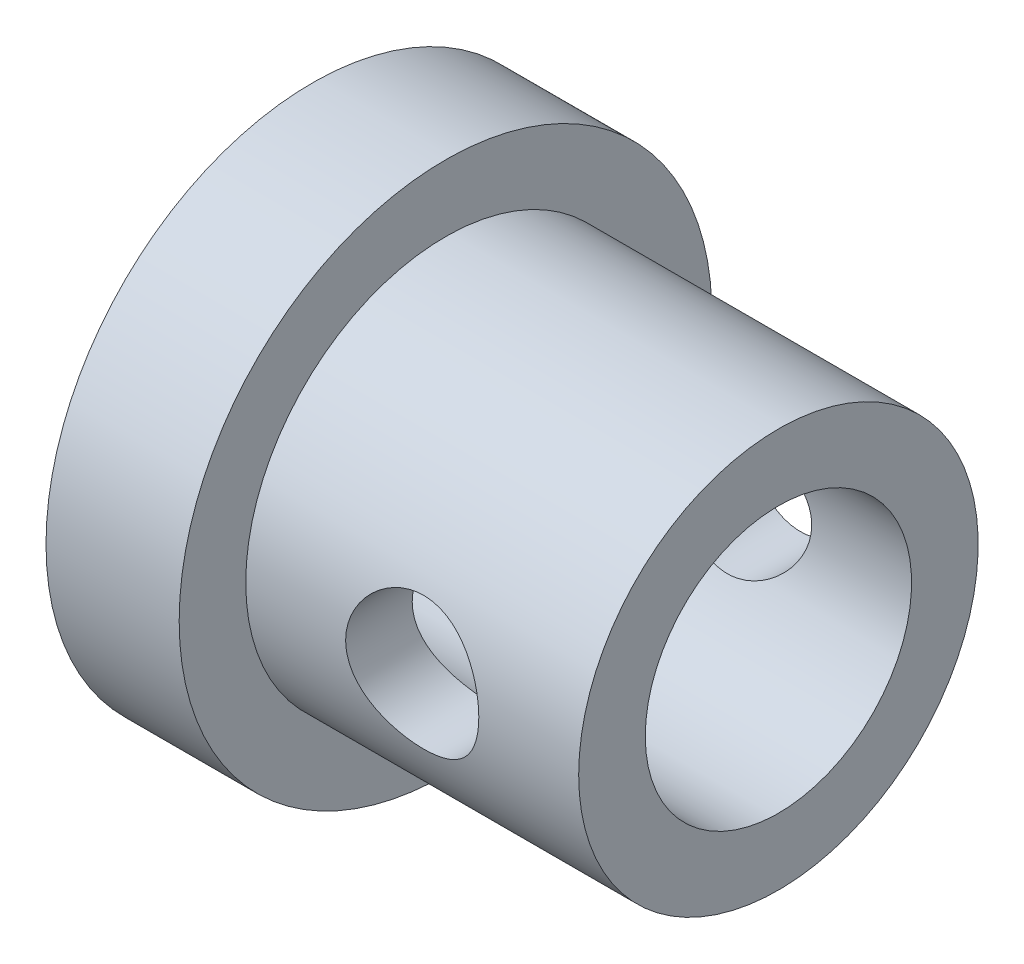
ISO-10303-21;
HEADER;
FILE_DESCRIPTION(('STEP AP214'),'2;1');
FILE_NAME('part.step','',(''),(''),'','','');
FILE_SCHEMA(('AUTOMOTIVE_DESIGN { 1 0 10303 214 1 1 1 1 }'));
ENDSEC;
DATA;
#1=APPLICATION_CONTEXT('core data for automotive mechanical design processes');
#2=APPLICATION_PROTOCOL_DEFINITION('international standard','automotive_design',2000,#1);
#3=PRODUCT_CONTEXT('',#1,'mechanical');
#4=PRODUCT('Part','Part','',(#3));
#5=PRODUCT_RELATED_PRODUCT_CATEGORY('part','',(#4));
#6=PRODUCT_DEFINITION_FORMATION('','',#4);
#7=PRODUCT_DEFINITION_CONTEXT('part definition',#1,'design');
#8=PRODUCT_DEFINITION('design','',#6,#7);
#9=PRODUCT_DEFINITION_SHAPE('','',#8);
#10=(LENGTH_UNIT() NAMED_UNIT(*) SI_UNIT(.MILLI.,.METRE.));
#11=(NAMED_UNIT(*) PLANE_ANGLE_UNIT() SI_UNIT($,.RADIAN.));
#12=(NAMED_UNIT(*) SI_UNIT($,.STERADIAN.) SOLID_ANGLE_UNIT());
#13=UNCERTAINTY_MEASURE_WITH_UNIT(LENGTH_MEASURE(1.E-05),#10,'distance_accuracy_value','');
#14=(GEOMETRIC_REPRESENTATION_CONTEXT(3) GLOBAL_UNCERTAINTY_ASSIGNED_CONTEXT((#13)) GLOBAL_UNIT_ASSIGNED_CONTEXT((#10,
#11,#12)) REPRESENTATION_CONTEXT('',''));
#15=CARTESIAN_POINT('',(0.,0.,0.));
#16=DIRECTION('',(0.,0.,1.));
#17=DIRECTION('',(1.,0.,0.));
#18=AXIS2_PLACEMENT_3D('',#15,#16,#17);
#19=CARTESIAN_POINT('',(0.,4.,0.));
#20=DIRECTION('',(1.,0.,0.));
#21=DIRECTION('',(0.,0.,-1.));
#22=AXIS2_PLACEMENT_3D('',#19,#20,#21);
#23=PLANE('',#22);
#24=CARTESIAN_POINT('',(0.,0.,0.));
#25=DIRECTION('',(-1.,0.,0.));
#26=DIRECTION('',(0.,0.,1.));
#27=AXIS2_PLACEMENT_3D('',#24,#25,#26);
#28=CIRCLE('',#27,2.);
#29=CARTESIAN_POINT('',(0.,0.,2.));
#30=VERTEX_POINT('',#29);
#31=EDGE_CURVE('E106',#30,#30,#28,.T.);
#32=ORIENTED_EDGE('',*,*,#31,.F.);
#33=EDGE_LOOP('',(#32));
#34=FACE_BOUND('',#33,.T.);
#35=CARTESIAN_POINT('',(0.,0.,0.));
#36=DIRECTION('',(-1.,0.,0.));
#37=DIRECTION('',(0.,0.,1.));
#38=AXIS2_PLACEMENT_3D('',#35,#36,#37);
#39=CIRCLE('',#38,4.);
#40=CARTESIAN_POINT('',(0.,0.,4.));
#41=VERTEX_POINT('',#40);
#42=EDGE_CURVE('E105',#41,#41,#39,.T.);
#43=ORIENTED_EDGE('',*,*,#42,.T.);
#44=EDGE_LOOP('',(#43));
#45=FACE_BOUND('',#44,.T.);
#46=ADVANCED_FACE('F37',(#34,#45),#23,.F.);
#47=CARTESIAN_POINT('',(7.,0.,0.));
#48=DIRECTION('',(-1.,0.,0.));
#49=DIRECTION('',(0.,0.,1.));
#50=AXIS2_PLACEMENT_3D('',#47,#48,#49);
#51=PLANE('',#50);
#52=CARTESIAN_POINT('',(7.,0.,0.));
#53=DIRECTION('',(-1.,0.,0.));
#54=DIRECTION('',(0.,0.,1.));
#55=AXIS2_PLACEMENT_3D('',#52,#53,#54);
#56=CIRCLE('',#55,2.);
#57=CARTESIAN_POINT('',(7.,0.,2.));
#58=VERTEX_POINT('',#57);
#59=EDGE_CURVE('E103',#58,#58,#56,.T.);
#60=ORIENTED_EDGE('',*,*,#59,.T.);
#61=EDGE_LOOP('',(#60));
#62=FACE_BOUND('',#61,.T.);
#63=CARTESIAN_POINT('',(7.,0.,0.));
#64=DIRECTION('',(-1.,0.,0.));
#65=DIRECTION('',(0.,0.,1.));
#66=AXIS2_PLACEMENT_3D('',#63,#64,#65);
#67=CIRCLE('',#66,3.);
#68=CARTESIAN_POINT('',(7.,0.,3.));
#69=VERTEX_POINT('',#68);
#70=EDGE_CURVE('E10',#69,#69,#67,.T.);
#71=ORIENTED_EDGE('',*,*,#70,.F.);
#72=EDGE_LOOP('',(#71));
#73=FACE_BOUND('',#72,.T.);
#74=ADVANCED_FACE('F91',(#62,#73),#51,.F.);
#75=CARTESIAN_POINT('',(0.,0.,0.));
#76=DIRECTION('',(-1.,0.,0.));
#77=DIRECTION('',(0.,0.,1.));
#78=AXIS2_PLACEMENT_3D('',#75,#76,#77);
#79=CYLINDRICAL_SURFACE('',#78,3.);
#80=CARTESIAN_POINT('',(5.5,0.,3.));
#81=CARTESIAN_POINT('',(5.50000025373164,-0.0545633628867233,3.00000015300943));
#82=CARTESIAN_POINT('',(5.49551973387278,-0.10912519453855,2.99849769507545));
#83=CARTESIAN_POINT('',(5.47777089118278,-0.216641760872972,2.99265210203281));
#84=CARTESIAN_POINT('',(5.46450165605108,-0.269596328118818,2.98830867202153));
#85=CARTESIAN_POINT('',(5.42968075661595,-0.372332789501776,2.97725307906443));
#86=CARTESIAN_POINT('',(5.40814293754073,-0.422119825886034,2.97054487730853));
#87=CARTESIAN_POINT('',(5.35745882716165,-0.517374936805325,2.95544445717342));
#88=CARTESIAN_POINT('',(5.3283110349974,-0.562842156958706,2.94705190667778));
#89=CARTESIAN_POINT('',(5.26217419514125,-0.649741675022266,2.92914094443005));
#90=CARTESIAN_POINT('',(5.22496876573951,-0.691003700298309,2.91959556463785));
#91=CARTESIAN_POINT('',(5.14423284529343,-0.766832692702084,2.90060314783121));
#92=CARTESIAN_POINT('',(5.10070096507149,-0.801398185489462,2.89115613290549));
#93=CARTESIAN_POINT('',(5.00701488480354,-0.863824942227859,2.87313332477274));
#94=CARTESIAN_POINT('',(4.95670626026788,-0.891464858221032,2.86459039275688));
#95=CARTESIAN_POINT('',(4.85182390554145,-0.937818873877721,2.84975305418601));
#96=CARTESIAN_POINT('',(4.79725148283726,-0.956535697386765,2.84345796160746));
#97=CARTESIAN_POINT('',(4.68732677850329,-0.983873461509163,2.83411303269377));
#98=CARTESIAN_POINT('',(4.63206279151094,-0.992813448271769,2.83096095769611));
#99=CARTESIAN_POINT('',(4.52073624584412,-1.00134112333448,2.82795656629508));
#100=CARTESIAN_POINT('',(4.46467393929081,-1.00093170160472,2.8281032302273));
#101=CARTESIAN_POINT('',(4.35606336955598,-0.991019903703419,2.8315901500818));
#102=CARTESIAN_POINT('',(4.30347159708098,-0.981933913166994,2.83478415867533));
#103=CARTESIAN_POINT('',(4.20060658039317,-0.955606162849417,2.84376657724551));
#104=CARTESIAN_POINT('',(4.15033361456493,-0.938363426591871,2.84955529784108));
#105=CARTESIAN_POINT('',(4.05258725040852,-0.895939058060211,2.86317911131249));
#106=CARTESIAN_POINT('',(4.00517197453047,-0.870634048707262,2.87104565793117));
#107=CARTESIAN_POINT('',(3.91512909172027,-0.812889106303139,2.88792558575726));
#108=CARTESIAN_POINT('',(3.87250287306662,-0.780447112364005,2.89693929790464));
#109=CARTESIAN_POINT('',(3.79090840183923,-0.707349332682237,2.91567329167741));
#110=CARTESIAN_POINT('',(3.75224730549093,-0.666353150076311,2.92540589354843));
#111=CARTESIAN_POINT('',(3.6822687333366,-0.578339569970063,2.94406938387037));
#112=CARTESIAN_POINT('',(3.6509519618355,-0.531321595660814,2.95300019538067));
#113=CARTESIAN_POINT('',(3.59630369976493,-0.431947613046267,2.96917107937794));
#114=CARTESIAN_POINT('',(3.57305450865927,-0.379543276416336,2.97639350008039));
#115=CARTESIAN_POINT('',(3.53579682604429,-0.271269083364507,2.98820567144435));
#116=CARTESIAN_POINT('',(3.52178512457656,-0.215400438154953,2.99279633654878));
#117=CARTESIAN_POINT('',(3.50394433397764,-0.104383829529303,2.99867627071441));
#118=CARTESIAN_POINT('',(3.49970019082725,-0.0493095998648449,3.00010001833731));
#119=CARTESIAN_POINT('',(3.50033267359847,0.0607750699602366,2.99988902694825));
#120=CARTESIAN_POINT('',(3.50520775997987,0.115785519319647,2.99825480419352));
#121=CARTESIAN_POINT('',(3.52361190773597,0.222519866304259,2.99220024717114));
#122=CARTESIAN_POINT('',(3.53688620604952,0.274292806834856,2.98786198711228));
#123=CARTESIAN_POINT('',(3.5713934444667,0.374855958579561,2.97691846830034));
#124=CARTESIAN_POINT('',(3.59262739946768,0.423645788508559,2.97031292046541));
#125=CARTESIAN_POINT('',(3.6430704318409,0.518288296393322,2.95528931287427));
#126=CARTESIAN_POINT('',(3.6724745932836,0.56402995921733,2.94682814756305));
#127=CARTESIAN_POINT('',(3.73819415001306,0.650064830135404,2.92905253915743));
#128=CARTESIAN_POINT('',(3.77451165603016,0.690356367794894,2.91973783591888));
#129=CARTESIAN_POINT('',(3.85497875100826,0.766252507807013,2.90076847982472));
#130=CARTESIAN_POINT('',(3.89940922693325,0.801560969248491,2.89111761095155));
#131=CARTESIAN_POINT('',(3.9937715678045,0.864257522320853,2.87299973286981));
#132=CARTESIAN_POINT('',(4.0437034786102,0.891645547920843,2.8645327335312));
#133=CARTESIAN_POINT('',(4.1476730153066,0.937596930423361,2.84982391820308));
#134=CARTESIAN_POINT('',(4.20170207924278,0.956178132197766,2.84357760900632));
#135=CARTESIAN_POINT('',(4.31237865012415,0.983894666792163,2.83410832399133));
#136=CARTESIAN_POINT('',(4.36902496543307,0.993034254961244,2.83088398622698));
#137=CARTESIAN_POINT('',(4.48019709601321,1.00127628247038,2.82797858875071));
#138=CARTESIAN_POINT('',(4.53468234025174,1.00087025731093,2.82812400344299));
#139=CARTESIAN_POINT('',(4.64276507489974,0.991242293454877,2.8315126992356));
#140=CARTESIAN_POINT('',(4.69636261795291,0.982020879458886,2.83475579595884));
#141=CARTESIAN_POINT('',(4.80013566301267,0.95537181312698,2.84384524278943));
#142=CARTESIAN_POINT('',(4.85035682500723,0.938103346014879,2.84964098015514));
#143=CARTESIAN_POINT('',(4.94722740693553,0.895979365760381,2.86316398825434));
#144=CARTESIAN_POINT('',(4.99387603118726,0.871122168553979,2.87089168765297));
#145=CARTESIAN_POINT('',(5.08448366992369,0.813260692583248,2.8878282922406));
#146=CARTESIAN_POINT('',(5.1282365018986,0.779948242764532,2.89708711641604));
#147=CARTESIAN_POINT('',(5.20968981338399,0.706642883135697,2.91583356283786));
#148=CARTESIAN_POINT('',(5.24738857568802,0.666648084451495,2.92532124912518));
#149=CARTESIAN_POINT('',(5.31714441228924,0.579241556920674,2.94390030525393));
#150=CARTESIAN_POINT('',(5.34892434775101,0.531601513499725,2.95296181801216));
#151=CARTESIAN_POINT('',(5.40399042885063,0.431357357406628,2.96925991172652));
#152=CARTESIAN_POINT('',(5.42727874592204,0.37875451813235,2.9764969590794));
#153=CARTESIAN_POINT('',(5.46372163248868,0.272493647200975,2.98805515068532));
#154=CARTESIAN_POINT('',(5.47728246626338,0.218987757676409,2.9924921242252));
#155=CARTESIAN_POINT('',(5.49542028067712,0.110320416010247,2.99846407064224));
#156=CARTESIAN_POINT('',(5.49999974349654,0.0551594255687466,2.99999984531906));
#157=CARTESIAN_POINT('',(5.5,0.,3.));
#158=B_SPLINE_CURVE_WITH_KNOTS('',3,(#80,#81,#82,#83,#84,#85,#86,#87,#88,#89,#90,#91,#92,#93,
#94,#95,#96,#97,#98,#99,#100,#101,#102,#103,#104,#105,#106,#107,#108,#109,#110,#111,#112,#113,
#114,#115,#116,#117,#118,#119,#120,#121,#122,#123,#124,#125,#126,#127,#128,#129,#130,#131,#132,
#133,#134,#135,#136,#137,#138,#139,#140,#141,#142,#143,#144,#145,#146,#147,#148,#149,#150,#151,
#152,#153,#154,#155,#156,#157),.UNSPECIFIED.,.T.,.F.,(4,2,2,2,2,2,2,2,2,2,2,2,2,2,2,2,2,2,2,2,2,
2,2,2,2,2,2,2,2,2,2,2,2,2,2,2,2,2,4),(0.,0.163487106026011,0.326991185267521,0.490222672870274,
0.6534863777991,0.82184684282756,0.990244332875302,1.1634838482347,1.33667044692833,
1.5040192574184,1.67131633987485,1.8309682655128,1.99063930855482,2.15288171155131,
2.31517102558207,2.48593305811367,2.65671145966618,2.82918405650358,3.00159668877208,
3.1665358317517,3.33144713164177,3.49158157978213,3.65173645284104,3.81610399843736,
3.98052180821891,4.15241022880752,4.32430008234997,4.49584013824416,4.66730284700846,
4.82995666056619,4.99260079341185,5.15215587070227,5.31174638165787,5.47830066681615,
5.64490211113589,5.8179966082491,5.99104681142266,6.15636558363623,6.3216386602795),.UNSPECIFIED.);
#159=CARTESIAN_POINT('',(5.5,0.,3.));
#160=VERTEX_POINT('',#159);
#161=EDGE_CURVE('E81',#160,#160,#158,.T.);
#162=ORIENTED_EDGE('',*,*,#161,.T.);
#163=EDGE_LOOP('',(#162));
#164=FACE_BOUND('',#163,.T.);
#165=CARTESIAN_POINT('',(5.5,0.,-3.));
#166=CARTESIAN_POINT('',(5.50000025373164,0.0545633628867233,-3.00000015300943));
#167=CARTESIAN_POINT('',(5.49551973387278,0.10912519453855,-2.99849769507545));
#168=CARTESIAN_POINT('',(5.47777089118278,0.216641760872972,-2.99265210203281));
#169=CARTESIAN_POINT('',(5.46450165605108,0.269596328118818,-2.98830867202153));
#170=CARTESIAN_POINT('',(5.42968075661595,0.372332789501776,-2.97725307906443));
#171=CARTESIAN_POINT('',(5.40814293754073,0.422119825886034,-2.97054487730853));
#172=CARTESIAN_POINT('',(5.35745882716165,0.517374936805325,-2.95544445717342));
#173=CARTESIAN_POINT('',(5.3283110349974,0.562842156958706,-2.94705190667778));
#174=CARTESIAN_POINT('',(5.26217419514125,0.649741675022266,-2.92914094443005));
#175=CARTESIAN_POINT('',(5.22496876573951,0.691003700298309,-2.91959556463785));
#176=CARTESIAN_POINT('',(5.14423284529343,0.766832692702084,-2.90060314783121));
#177=CARTESIAN_POINT('',(5.10070096507149,0.801398185489462,-2.89115613290549));
#178=CARTESIAN_POINT('',(5.00701488480354,0.863824942227859,-2.87313332477274));
#179=CARTESIAN_POINT('',(4.95670626026788,0.891464858221032,-2.86459039275688));
#180=CARTESIAN_POINT('',(4.85182390554145,0.937818873877721,-2.84975305418601));
#181=CARTESIAN_POINT('',(4.79725148283726,0.956535697386765,-2.84345796160746));
#182=CARTESIAN_POINT('',(4.68732677850329,0.983873461509163,-2.83411303269377));
#183=CARTESIAN_POINT('',(4.63206279151094,0.992813448271769,-2.83096095769611));
#184=CARTESIAN_POINT('',(4.52073624584412,1.00134112333448,-2.82795656629508));
#185=CARTESIAN_POINT('',(4.46467393929081,1.00093170160472,-2.8281032302273));
#186=CARTESIAN_POINT('',(4.35606336955598,0.991019903703419,-2.8315901500818));
#187=CARTESIAN_POINT('',(4.30347159708098,0.981933913166994,-2.83478415867533));
#188=CARTESIAN_POINT('',(4.20060658039317,0.955606162849417,-2.84376657724551));
#189=CARTESIAN_POINT('',(4.15033361456493,0.938363426591871,-2.84955529784108));
#190=CARTESIAN_POINT('',(4.05258725040852,0.895939058060211,-2.86317911131249));
#191=CARTESIAN_POINT('',(4.00517197453047,0.870634048707262,-2.87104565793117));
#192=CARTESIAN_POINT('',(3.91512909172027,0.812889106303139,-2.88792558575726));
#193=CARTESIAN_POINT('',(3.87250287306662,0.780447112364005,-2.89693929790464));
#194=CARTESIAN_POINT('',(3.79090840183923,0.707349332682237,-2.91567329167741));
#195=CARTESIAN_POINT('',(3.75224730549093,0.666353150076311,-2.92540589354843));
#196=CARTESIAN_POINT('',(3.6822687333366,0.578339569970063,-2.94406938387037));
#197=CARTESIAN_POINT('',(3.6509519618355,0.531321595660814,-2.95300019538067));
#198=CARTESIAN_POINT('',(3.59630369976493,0.431947613046267,-2.96917107937794));
#199=CARTESIAN_POINT('',(3.57305450865927,0.379543276416336,-2.97639350008039));
#200=CARTESIAN_POINT('',(3.53579682604429,0.271269083364507,-2.98820567144435));
#201=CARTESIAN_POINT('',(3.52178512457656,0.215400438154953,-2.99279633654878));
#202=CARTESIAN_POINT('',(3.50394433397764,0.104383829529303,-2.99867627071441));
#203=CARTESIAN_POINT('',(3.49970019082725,0.0493095998648449,-3.00010001833731));
#204=CARTESIAN_POINT('',(3.50033267359847,-0.0607750699602366,-2.99988902694825));
#205=CARTESIAN_POINT('',(3.50520775997987,-0.115785519319647,-2.99825480419352));
#206=CARTESIAN_POINT('',(3.52361190773597,-0.222519866304259,-2.99220024717114));
#207=CARTESIAN_POINT('',(3.53688620604952,-0.274292806834856,-2.98786198711228));
#208=CARTESIAN_POINT('',(3.5713934444667,-0.374855958579561,-2.97691846830034));
#209=CARTESIAN_POINT('',(3.59262739946768,-0.423645788508559,-2.97031292046541));
#210=CARTESIAN_POINT('',(3.6430704318409,-0.518288296393322,-2.95528931287427));
#211=CARTESIAN_POINT('',(3.6724745932836,-0.56402995921733,-2.94682814756305));
#212=CARTESIAN_POINT('',(3.73819415001306,-0.650064830135404,-2.92905253915743));
#213=CARTESIAN_POINT('',(3.77451165603016,-0.690356367794894,-2.91973783591888));
#214=CARTESIAN_POINT('',(3.85497875100826,-0.766252507807013,-2.90076847982472));
#215=CARTESIAN_POINT('',(3.89940922693325,-0.801560969248491,-2.89111761095155));
#216=CARTESIAN_POINT('',(3.9937715678045,-0.864257522320853,-2.87299973286981));
#217=CARTESIAN_POINT('',(4.0437034786102,-0.891645547920843,-2.8645327335312));
#218=CARTESIAN_POINT('',(4.1476730153066,-0.937596930423361,-2.84982391820308));
#219=CARTESIAN_POINT('',(4.20170207924278,-0.956178132197766,-2.84357760900632));
#220=CARTESIAN_POINT('',(4.31237865012415,-0.983894666792163,-2.83410832399133));
#221=CARTESIAN_POINT('',(4.36902496543307,-0.993034254961244,-2.83088398622698));
#222=CARTESIAN_POINT('',(4.48019709601321,-1.00127628247038,-2.82797858875071));
#223=CARTESIAN_POINT('',(4.53468234025174,-1.00087025731093,-2.82812400344299));
#224=CARTESIAN_POINT('',(4.64276507489974,-0.991242293454877,-2.8315126992356));
#225=CARTESIAN_POINT('',(4.69636261795291,-0.982020879458886,-2.83475579595884));
#226=CARTESIAN_POINT('',(4.80013566301267,-0.95537181312698,-2.84384524278943));
#227=CARTESIAN_POINT('',(4.85035682500723,-0.938103346014879,-2.84964098015514));
#228=CARTESIAN_POINT('',(4.94722740693553,-0.895979365760381,-2.86316398825434));
#229=CARTESIAN_POINT('',(4.99387603118726,-0.871122168553979,-2.87089168765297));
#230=CARTESIAN_POINT('',(5.08448366992369,-0.813260692583248,-2.8878282922406));
#231=CARTESIAN_POINT('',(5.1282365018986,-0.779948242764532,-2.89708711641604));
#232=CARTESIAN_POINT('',(5.20968981338399,-0.706642883135697,-2.91583356283786));
#233=CARTESIAN_POINT('',(5.24738857568802,-0.666648084451495,-2.92532124912518));
#234=CARTESIAN_POINT('',(5.31714441228924,-0.579241556920674,-2.94390030525393));
#235=CARTESIAN_POINT('',(5.34892434775101,-0.531601513499725,-2.95296181801216));
#236=CARTESIAN_POINT('',(5.40399042885063,-0.431357357406628,-2.96925991172652));
#237=CARTESIAN_POINT('',(5.42727874592204,-0.37875451813235,-2.9764969590794));
#238=CARTESIAN_POINT('',(5.46372163248868,-0.272493647200975,-2.98805515068532));
#239=CARTESIAN_POINT('',(5.47728246626338,-0.218987757676409,-2.9924921242252));
#240=CARTESIAN_POINT('',(5.49542028067712,-0.110320416010247,-2.99846407064224));
#241=CARTESIAN_POINT('',(5.49999974349654,-0.0551594255687466,-2.99999984531906));
#242=CARTESIAN_POINT('',(5.5,0.,-3.));
#243=B_SPLINE_CURVE_WITH_KNOTS('',3,(#165,#166,#167,#168,#169,#170,#171,#172,#173,#174,#175,
#176,#177,#178,#179,#180,#181,#182,#183,#184,#185,#186,#187,#188,#189,#190,#191,#192,#193,#194,
#195,#196,#197,#198,#199,#200,#201,#202,#203,#204,#205,#206,#207,#208,#209,#210,#211,#212,#213,
#214,#215,#216,#217,#218,#219,#220,#221,#222,#223,#224,#225,#226,#227,#228,#229,#230,#231,#232,
#233,#234,#235,#236,#237,#238,#239,#240,#241,#242),.UNSPECIFIED.,.T.,.F.,(4,2,2,2,2,2,2,2,2,2,2,
2,2,2,2,2,2,2,2,2,2,2,2,2,2,2,2,2,2,2,2,2,2,2,2,2,2,2,4),(0.,0.163487106026011,
0.326991185267521,0.490222672870274,0.6534863777991,0.82184684282756,0.990244332875302,
1.1634838482347,1.33667044692833,1.5040192574184,1.67131633987485,1.8309682655128,
1.99063930855482,2.15288171155131,2.31517102558207,2.48593305811367,2.65671145966618,
2.82918405650358,3.00159668877208,3.1665358317517,3.33144713164177,3.49158157978213,
3.65173645284104,3.81610399843736,3.98052180821891,4.15241022880752,4.32430008234997,
4.49584013824416,4.66730284700846,4.82995666056619,4.99260079341185,5.15215587070227,
5.31174638165787,5.47830066681615,5.64490211113589,5.8179966082491,5.99104681142266,
6.15636558363623,6.3216386602795),.UNSPECIFIED.);
#244=CARTESIAN_POINT('',(5.5,0.,-3.));
#245=VERTEX_POINT('',#244);
#246=EDGE_CURVE('E75',#245,#245,#243,.T.);
#247=ORIENTED_EDGE('',*,*,#246,.T.);
#248=EDGE_LOOP('',(#247));
#249=FACE_BOUND('',#248,.T.);
#250=CARTESIAN_POINT('',(2.,0.,0.));
#251=DIRECTION('',(-1.,0.,0.));
#252=DIRECTION('',(0.,0.,1.));
#253=AXIS2_PLACEMENT_3D('',#250,#251,#252);
#254=CIRCLE('',#253,3.);
#255=CARTESIAN_POINT('',(2.,0.,3.));
#256=VERTEX_POINT('',#255);
#257=EDGE_CURVE('E49',#256,#256,#254,.T.);
#258=ORIENTED_EDGE('',*,*,#257,.F.);
#259=EDGE_LOOP('',(#258));
#260=FACE_BOUND('',#259,.T.);
#261=ORIENTED_EDGE('',*,*,#70,.T.);
#262=EDGE_LOOP('',(#261));
#263=FACE_BOUND('',#262,.T.);
#264=ADVANCED_FACE('F86',(#164,#249,#260,#263),#79,.T.);
#265=CARTESIAN_POINT('',(2.,3.,0.));
#266=DIRECTION('',(-1.,0.,0.));
#267=DIRECTION('',(0.,0.,1.));
#268=AXIS2_PLACEMENT_3D('',#265,#266,#267);
#269=PLANE('',#268);
#270=CARTESIAN_POINT('',(2.,0.,0.));
#271=DIRECTION('',(-1.,0.,0.));
#272=DIRECTION('',(0.,0.,1.));
#273=AXIS2_PLACEMENT_3D('',#270,#271,#272);
#274=CIRCLE('',#273,4.);
#275=CARTESIAN_POINT('',(2.,0.,4.));
#276=VERTEX_POINT('',#275);
#277=EDGE_CURVE('E54',#276,#276,#274,.T.);
#278=ORIENTED_EDGE('',*,*,#277,.F.);
#279=EDGE_LOOP('',(#278));
#280=FACE_BOUND('',#279,.T.);
#281=ORIENTED_EDGE('',*,*,#257,.T.);
#282=EDGE_LOOP('',(#281));
#283=FACE_BOUND('',#282,.T.);
#284=ADVANCED_FACE('F90',(#280,#283),#269,.F.);
#285=CARTESIAN_POINT('',(0.,0.,0.));
#286=DIRECTION('',(-1.,0.,0.));
#287=DIRECTION('',(0.,0.,1.));
#288=AXIS2_PLACEMENT_3D('',#285,#286,#287);
#289=CYLINDRICAL_SURFACE('',#288,4.);
#290=ORIENTED_EDGE('',*,*,#42,.F.);
#291=EDGE_LOOP('',(#290));
#292=FACE_BOUND('',#291,.T.);
#293=ORIENTED_EDGE('',*,*,#277,.T.);
#294=EDGE_LOOP('',(#293));
#295=FACE_BOUND('',#294,.T.);
#296=ADVANCED_FACE('F114',(#292,#295),#289,.T.);
#297=CARTESIAN_POINT('',(7.,0.,0.));
#298=DIRECTION('',(-1.,0.,0.));
#299=DIRECTION('',(0.,0.,1.));
#300=AXIS2_PLACEMENT_3D('',#297,#298,#299);
#301=CYLINDRICAL_SURFACE('',#300,2.);
#302=CARTESIAN_POINT('',(5.5,0.,2.));
#303=CARTESIAN_POINT('',(5.4999966976805,0.0525719629529864,1.99999713404151));
#304=CARTESIAN_POINT('',(5.49582992687833,0.105206599698033,1.99790491019518));
#305=CARTESIAN_POINT('',(5.47934711965908,0.208920235268425,1.98974156037396));
#306=CARTESIAN_POINT('',(5.46701560700235,0.259996086713503,1.98366287828984));
#307=CARTESIAN_POINT('',(5.43480619138321,0.358933544880574,1.96816279403312));
#308=CARTESIAN_POINT('',(5.41495761575199,0.40680680293918,1.9587543917752));
#309=CARTESIAN_POINT('',(5.36842937863506,0.498472616806565,1.93745776515779));
#310=CARTESIAN_POINT('',(5.34175025575115,0.54226549399005,1.9255697363353));
#311=CARTESIAN_POINT('',(5.2804827505147,0.627507817761919,1.89956258258057));
#312=CARTESIAN_POINT('',(5.24551352076036,0.668655211122112,1.88535199127536));
#313=CARTESIAN_POINT('',(5.16947852075297,0.744779444866977,1.85659970246744));
#314=CARTESIAN_POINT('',(5.12840814822756,0.779751583106766,1.84205776209035));
#315=CARTESIAN_POINT('',(5.03751665047662,0.845252000450278,1.81298951197347));
#316=CARTESIAN_POINT('',(4.98726390165409,0.875225335551637,1.79855186970132));
#317=CARTESIAN_POINT('',(4.88163266401379,0.926168226890695,1.77285978772321));
#318=CARTESIAN_POINT('',(4.82625787127725,0.947144214966334,1.7616030760699));
#319=CARTESIAN_POINT('',(4.71533489457808,0.978132442188588,1.74457867037809));
#320=CARTESIAN_POINT('',(4.6599955479326,0.988725857080441,1.73852271583714));
#321=CARTESIAN_POINT('',(4.54802116222052,1.00042699330885,1.73181889948528));
#322=CARTESIAN_POINT('',(4.49138745912885,1.00154408837307,1.73116569343288));
#323=CARTESIAN_POINT('',(4.38571397568463,0.994687287172294,1.73510930257248));
#324=CARTESIAN_POINT('',(4.33657596877695,0.987784559536821,1.73908763662014));
#325=CARTESIAN_POINT('',(4.24027809062696,0.966939849056932,1.7507622873385));
#326=CARTESIAN_POINT('',(4.19311885469468,0.952995623897651,1.75845978831776));
#327=CARTESIAN_POINT('',(4.10077086743434,0.918209780386003,1.77687476412741));
#328=CARTESIAN_POINT('',(4.05565360121421,0.897215067115994,1.78765840663999));
#329=CARTESIAN_POINT('',(3.96936570740999,0.849041687668002,1.81103404281404));
#330=CARTESIAN_POINT('',(3.92819686439991,0.821860243812467,1.82362684780191));
#331=CARTESIAN_POINT('',(3.84547874725677,0.758066054912788,1.85113157903286));
#332=CARTESIAN_POINT('',(3.80454312642384,0.720694458369281,1.86613510236746));
#333=CARTESIAN_POINT('',(3.7292645814091,0.639555578741373,1.89547623300407));
#334=CARTESIAN_POINT('',(3.69492480796612,0.595785256574285,1.90981351958801));
#335=CARTESIAN_POINT('',(3.63231433897027,0.500516505831848,1.93701987282964));
#336=CARTESIAN_POINT('',(3.60439952755426,0.448753591599409,1.94978984162007));
#337=CARTESIAN_POINT('',(3.55790297095699,0.340466215488797,1.97157881121242));
#338=CARTESIAN_POINT('',(3.53931381498483,0.283945576265277,1.98060078943553));
#339=CARTESIAN_POINT('',(3.51352459628332,0.172766491660702,1.99324333741436));
#340=CARTESIAN_POINT('',(3.50550876425322,0.118341530548324,1.99724938301312));
#341=CARTESIAN_POINT('',(3.49853526886551,0.00877959994935334,2.00073013459102));
#342=CARTESIAN_POINT('',(3.49957331436052,-0.0463570198699016,2.00020698721312));
#343=CARTESIAN_POINT('',(3.51020668841875,-0.151232971985994,1.99491192253441));
#344=CARTESIAN_POINT('',(3.51913253273003,-0.201059408049954,1.9904724568819));
#345=CARTESIAN_POINT('',(3.54423807189509,-0.298406892301917,1.97822171314819));
#346=CARTESIAN_POINT('',(3.56041856645336,-0.345927685690997,1.97041006334332));
#347=CARTESIAN_POINT('',(3.59999846643317,-0.438888608449665,1.95184251413669));
#348=CARTESIAN_POINT('',(3.62359105011681,-0.484230397006154,1.94100881769939));
#349=CARTESIAN_POINT('',(3.67710753564604,-0.570461361698921,1.91743974317109));
#350=CARTESIAN_POINT('',(3.70703413459343,-0.611348629775282,1.90470355565785));
#351=CARTESIAN_POINT('',(3.77576042533287,-0.691767689290653,1.87708221337464));
#352=CARTESIAN_POINT('',(3.81514286845357,-0.730772077824639,1.86210884848441));
#353=CARTESIAN_POINT('',(3.89992515126931,-0.80185632111324,1.83262391603874));
#354=CARTESIAN_POINT('',(3.94532911881637,-0.833931385690841,1.81811267381526));
#355=CARTESIAN_POINT('',(4.04364365420031,-0.891707914497696,1.79051192226068));
#356=CARTESIAN_POINT('',(4.0968112662086,-0.917025495878637,1.77752529663472));
#357=CARTESIAN_POINT('',(4.20751006769252,-0.958082826013803,1.75574072368126));
#358=CARTESIAN_POINT('',(4.26503552650119,-0.97383491588757,1.74693738240618));
#359=CARTESIAN_POINT('',(4.37691022286145,-0.993861687449679,1.73561501008667));
#360=CARTESIAN_POINT('',(4.43103425342904,-0.999092996400864,1.73257383460491));
#361=CARTESIAN_POINT('',(4.53944706717073,-1.00068915438079,1.73165354646175));
#362=CARTESIAN_POINT('',(4.59373576873943,-0.997057846624399,1.73377219627553));
#363=CARTESIAN_POINT('',(4.69548350153202,-0.981926125592263,1.74237862050025));
#364=CARTESIAN_POINT('',(4.7431004701444,-0.971208314342799,1.74843094482394));
#365=CARTESIAN_POINT('',(4.83580811942471,-0.943175358224645,1.76371016187918));
#366=CARTESIAN_POINT('',(4.88089798209197,-0.92585809115981,1.77293807569676));
#367=CARTESIAN_POINT('',(4.97062485098661,-0.883815745300683,1.79428530364528));
#368=CARTESIAN_POINT('',(5.0150279018297,-0.858671137816458,1.80655722396191));
#369=CARTESIAN_POINT('',(5.09927453618059,-0.802150971636634,1.8323533163459));
#370=CARTESIAN_POINT('',(5.13911573051849,-0.770772171238648,1.84587813794522));
#371=CARTESIAN_POINT('',(5.21814198235762,-0.698203326664641,1.87462323159313));
#372=CARTESIAN_POINT('',(5.25665910236192,-0.656284423010171,1.88984983311469));
#373=CARTESIAN_POINT('',(5.32626298342363,-0.566154806220279,1.91877752255088));
#374=CARTESIAN_POINT('',(5.35734573942629,-0.517940723256784,1.9324777860804));
#375=CARTESIAN_POINT('',(5.41123636276221,-0.415931596819946,1.95698009585103));
#376=CARTESIAN_POINT('',(5.43398416941144,-0.362099503934614,1.96776096562909));
#377=CARTESIAN_POINT('',(5.46980816791895,-0.250742101294191,1.98501341363465));
#378=CARTESIAN_POINT('',(5.48291184682958,-0.193227799623165,1.99149723372932));
#379=CARTESIAN_POINT('',(5.49389741107585,-0.112601946483384,1.99695461909663));
#380=CARTESIAN_POINT('',(5.49618264086362,-0.0901618794394986,1.99809365339202));
#381=CARTESIAN_POINT('',(5.49923466551681,-0.0451517318071578,1.99961696977865));
#382=CARTESIAN_POINT('',(5.5000014184712,-0.0225816476473815,2.00000123103763));
#383=CARTESIAN_POINT('',(5.5,0.,2.));
#384=B_SPLINE_CURVE_WITH_KNOTS('',3,(#302,#303,#304,#305,#306,#307,#308,#309,#310,#311,#312,
#313,#314,#315,#316,#317,#318,#319,#320,#321,#322,#323,#324,#325,#326,#327,#328,#329,#330,#331,
#332,#333,#334,#335,#336,#337,#338,#339,#340,#341,#342,#343,#344,#345,#346,#347,#348,#349,#350,
#351,#352,#353,#354,#355,#356,#357,#358,#359,#360,#361,#362,#363,#364,#365,#366,#367,#368,#369,
#370,#371,#372,#373,#374,#375,#376,#377,#378,#379,#380,#381,#382,#383),.UNSPECIFIED.,.T.,.F.,(4,
2,2,2,2,2,2,2,2,2,2,2,2,2,2,2,2,2,2,2,2,2,2,2,2,2,2,2,2,2,2,2,2,2,2,2,2,2,2,2,4),(0.,
0.157624257420292,0.315548149709198,0.472862155492299,0.630163760581568,0.796981758718088,
0.963926237654035,1.14381726430753,1.32357947898281,1.4925801214023,1.6614135732902,
1.81005712409321,1.95874803925678,2.11090240168487,2.26312521260222,2.43464941333878,
2.60625534598686,2.78583022214441,2.96526216912279,3.12983290471346,3.29432564511476,
3.44606906506122,3.59782921630931,3.75392856027899,3.91009450748339,4.08159610644419,
4.25321588615432,4.43314682159674,4.61284511940778,4.77529307498373,4.93767059860005,
5.08457930244183,5.23153528783678,5.38836456775614,5.54527561138958,5.72125242752498,
5.89732383376573,6.07464013662925,6.2514490862493,6.31915280137697,6.38685838514847),.UNSPECIFIED.);
#385=CARTESIAN_POINT('',(5.5,0.,2.));
#386=VERTEX_POINT('',#385);
#387=EDGE_CURVE('E40',#386,#386,#384,.T.);
#388=ORIENTED_EDGE('',*,*,#387,.T.);
#389=EDGE_LOOP('',(#388));
#390=FACE_BOUND('',#389,.T.);
#391=CARTESIAN_POINT('',(5.5,0.,-2.));
#392=CARTESIAN_POINT('',(5.4999966976805,-0.0525719629529864,-1.99999713404151));
#393=CARTESIAN_POINT('',(5.49582992687833,-0.105206599698033,-1.99790491019518));
#394=CARTESIAN_POINT('',(5.47934711965908,-0.208920235268425,-1.98974156037396));
#395=CARTESIAN_POINT('',(5.46701560700235,-0.259996086713503,-1.98366287828984));
#396=CARTESIAN_POINT('',(5.43480619138321,-0.358933544880574,-1.96816279403312));
#397=CARTESIAN_POINT('',(5.41495761575199,-0.40680680293918,-1.9587543917752));
#398=CARTESIAN_POINT('',(5.36842937863506,-0.498472616806565,-1.93745776515779));
#399=CARTESIAN_POINT('',(5.34175025575115,-0.54226549399005,-1.9255697363353));
#400=CARTESIAN_POINT('',(5.2804827505147,-0.627507817761919,-1.89956258258057));
#401=CARTESIAN_POINT('',(5.24551352076036,-0.668655211122112,-1.88535199127536));
#402=CARTESIAN_POINT('',(5.16947852075297,-0.744779444866977,-1.85659970246744));
#403=CARTESIAN_POINT('',(5.12840814822756,-0.779751583106766,-1.84205776209035));
#404=CARTESIAN_POINT('',(5.03751665047662,-0.845252000450278,-1.81298951197347));
#405=CARTESIAN_POINT('',(4.98726390165409,-0.875225335551637,-1.79855186970132));
#406=CARTESIAN_POINT('',(4.88163266401379,-0.926168226890695,-1.77285978772321));
#407=CARTESIAN_POINT('',(4.82625787127725,-0.947144214966334,-1.7616030760699));
#408=CARTESIAN_POINT('',(4.71533489457808,-0.978132442188588,-1.74457867037809));
#409=CARTESIAN_POINT('',(4.6599955479326,-0.988725857080441,-1.73852271583714));
#410=CARTESIAN_POINT('',(4.54802116222052,-1.00042699330885,-1.73181889948528));
#411=CARTESIAN_POINT('',(4.49138745912885,-1.00154408837307,-1.73116569343288));
#412=CARTESIAN_POINT('',(4.38571397568463,-0.994687287172294,-1.73510930257248));
#413=CARTESIAN_POINT('',(4.33657596877695,-0.987784559536821,-1.73908763662014));
#414=CARTESIAN_POINT('',(4.24027809062696,-0.966939849056932,-1.7507622873385));
#415=CARTESIAN_POINT('',(4.19311885469468,-0.952995623897651,-1.75845978831776));
#416=CARTESIAN_POINT('',(4.10077086743434,-0.918209780386003,-1.77687476412741));
#417=CARTESIAN_POINT('',(4.05565360121421,-0.897215067115994,-1.78765840663999));
#418=CARTESIAN_POINT('',(3.96936570740999,-0.849041687668002,-1.81103404281404));
#419=CARTESIAN_POINT('',(3.92819686439991,-0.821860243812467,-1.82362684780191));
#420=CARTESIAN_POINT('',(3.84547874725677,-0.758066054912788,-1.85113157903286));
#421=CARTESIAN_POINT('',(3.80454312642384,-0.720694458369281,-1.86613510236746));
#422=CARTESIAN_POINT('',(3.7292645814091,-0.639555578741373,-1.89547623300407));
#423=CARTESIAN_POINT('',(3.69492480796612,-0.595785256574285,-1.90981351958801));
#424=CARTESIAN_POINT('',(3.63231433897027,-0.500516505831848,-1.93701987282964));
#425=CARTESIAN_POINT('',(3.60439952755426,-0.448753591599409,-1.94978984162007));
#426=CARTESIAN_POINT('',(3.55790297095699,-0.340466215488797,-1.97157881121242));
#427=CARTESIAN_POINT('',(3.53931381498483,-0.283945576265277,-1.98060078943553));
#428=CARTESIAN_POINT('',(3.51352459628332,-0.172766491660702,-1.99324333741436));
#429=CARTESIAN_POINT('',(3.50550876425322,-0.118341530548324,-1.99724938301312));
#430=CARTESIAN_POINT('',(3.49853526886551,-0.00877959994935334,-2.00073013459102));
#431=CARTESIAN_POINT('',(3.49957331436052,0.0463570198699016,-2.00020698721312));
#432=CARTESIAN_POINT('',(3.51020668841875,0.151232971985994,-1.99491192253441));
#433=CARTESIAN_POINT('',(3.51913253273003,0.201059408049954,-1.9904724568819));
#434=CARTESIAN_POINT('',(3.54423807189509,0.298406892301917,-1.97822171314819));
#435=CARTESIAN_POINT('',(3.56041856645336,0.345927685690997,-1.97041006334332));
#436=CARTESIAN_POINT('',(3.59999846643317,0.438888608449665,-1.95184251413669));
#437=CARTESIAN_POINT('',(3.62359105011681,0.484230397006154,-1.94100881769939));
#438=CARTESIAN_POINT('',(3.67710753564604,0.570461361698921,-1.91743974317109));
#439=CARTESIAN_POINT('',(3.70703413459343,0.611348629775282,-1.90470355565785));
#440=CARTESIAN_POINT('',(3.77576042533287,0.691767689290653,-1.87708221337464));
#441=CARTESIAN_POINT('',(3.81514286845357,0.730772077824639,-1.86210884848441));
#442=CARTESIAN_POINT('',(3.89992515126931,0.80185632111324,-1.83262391603874));
#443=CARTESIAN_POINT('',(3.94532911881637,0.833931385690841,-1.81811267381526));
#444=CARTESIAN_POINT('',(4.04364365420031,0.891707914497696,-1.79051192226068));
#445=CARTESIAN_POINT('',(4.0968112662086,0.917025495878637,-1.77752529663472));
#446=CARTESIAN_POINT('',(4.20751006769252,0.958082826013803,-1.75574072368126));
#447=CARTESIAN_POINT('',(4.26503552650119,0.97383491588757,-1.74693738240618));
#448=CARTESIAN_POINT('',(4.37691022286145,0.993861687449679,-1.73561501008667));
#449=CARTESIAN_POINT('',(4.43103425342904,0.999092996400864,-1.73257383460491));
#450=CARTESIAN_POINT('',(4.53944706717073,1.00068915438079,-1.73165354646175));
#451=CARTESIAN_POINT('',(4.59373576873943,0.997057846624399,-1.73377219627553));
#452=CARTESIAN_POINT('',(4.69548350153202,0.981926125592263,-1.74237862050025));
#453=CARTESIAN_POINT('',(4.7431004701444,0.971208314342799,-1.74843094482394));
#454=CARTESIAN_POINT('',(4.83580811942471,0.943175358224645,-1.76371016187918));
#455=CARTESIAN_POINT('',(4.88089798209197,0.92585809115981,-1.77293807569676));
#456=CARTESIAN_POINT('',(4.97062485098661,0.883815745300683,-1.79428530364528));
#457=CARTESIAN_POINT('',(5.0150279018297,0.858671137816458,-1.80655722396191));
#458=CARTESIAN_POINT('',(5.09927453618059,0.802150971636634,-1.8323533163459));
#459=CARTESIAN_POINT('',(5.13911573051849,0.770772171238648,-1.84587813794522));
#460=CARTESIAN_POINT('',(5.21814198235762,0.698203326664641,-1.87462323159313));
#461=CARTESIAN_POINT('',(5.25665910236192,0.656284423010171,-1.88984983311469));
#462=CARTESIAN_POINT('',(5.32626298342363,0.566154806220279,-1.91877752255088));
#463=CARTESIAN_POINT('',(5.35734573942629,0.517940723256784,-1.9324777860804));
#464=CARTESIAN_POINT('',(5.41123636276221,0.415931596819946,-1.95698009585103));
#465=CARTESIAN_POINT('',(5.43398416941144,0.362099503934614,-1.96776096562909));
#466=CARTESIAN_POINT('',(5.46980816791895,0.250742101294191,-1.98501341363465));
#467=CARTESIAN_POINT('',(5.48291184682958,0.193227799623165,-1.99149723372932));
#468=CARTESIAN_POINT('',(5.49389741107585,0.112601946483384,-1.99695461909663));
#469=CARTESIAN_POINT('',(5.49618264086362,0.0901618794394986,-1.99809365339202));
#470=CARTESIAN_POINT('',(5.49923466551681,0.0451517318071578,-1.99961696977865));
#471=CARTESIAN_POINT('',(5.5000014184712,0.0225816476473815,-2.00000123103763));
#472=CARTESIAN_POINT('',(5.5,0.,-2.));
#473=B_SPLINE_CURVE_WITH_KNOTS('',3,(#391,#392,#393,#394,#395,#396,#397,#398,#399,#400,#401,
#402,#403,#404,#405,#406,#407,#408,#409,#410,#411,#412,#413,#414,#415,#416,#417,#418,#419,#420,
#421,#422,#423,#424,#425,#426,#427,#428,#429,#430,#431,#432,#433,#434,#435,#436,#437,#438,#439,
#440,#441,#442,#443,#444,#445,#446,#447,#448,#449,#450,#451,#452,#453,#454,#455,#456,#457,#458,
#459,#460,#461,#462,#463,#464,#465,#466,#467,#468,#469,#470,#471,#472),.UNSPECIFIED.,.T.,.F.,(4,
2,2,2,2,2,2,2,2,2,2,2,2,2,2,2,2,2,2,2,2,2,2,2,2,2,2,2,2,2,2,2,2,2,2,2,2,2,2,2,4),(0.,
0.157624257420292,0.315548149709198,0.472862155492299,0.630163760581568,0.796981758718088,
0.963926237654035,1.14381726430753,1.32357947898281,1.4925801214023,1.6614135732902,
1.81005712409321,1.95874803925678,2.11090240168487,2.26312521260222,2.43464941333878,
2.60625534598686,2.78583022214441,2.96526216912279,3.12983290471346,3.29432564511476,
3.44606906506122,3.59782921630931,3.75392856027899,3.91009450748339,4.08159610644419,
4.25321588615432,4.43314682159674,4.61284511940778,4.77529307498373,4.93767059860005,
5.08457930244183,5.23153528783678,5.38836456775614,5.54527561138958,5.72125242752498,
5.89732383376573,6.07464013662925,6.2514490862493,6.31915280137697,6.38685838514847),.UNSPECIFIED.);
#474=CARTESIAN_POINT('',(5.5,0.,-2.));
#475=VERTEX_POINT('',#474);
#476=EDGE_CURVE('E57',#475,#475,#473,.T.);
#477=ORIENTED_EDGE('',*,*,#476,.T.);
#478=EDGE_LOOP('',(#477));
#479=FACE_BOUND('',#478,.T.);
#480=ORIENTED_EDGE('',*,*,#59,.F.);
#481=EDGE_LOOP('',(#480));
#482=FACE_BOUND('',#481,.T.);
#483=ORIENTED_EDGE('',*,*,#31,.T.);
#484=EDGE_LOOP('',(#483));
#485=FACE_BOUND('',#484,.T.);
#486=ADVANCED_FACE('F62',(#390,#479,#482,#485),#301,.F.);
#487=CARTESIAN_POINT('',(4.5,0.,-5.));
#488=DIRECTION('',(0.,0.,1.));
#489=DIRECTION('',(1.,0.,0.));
#490=AXIS2_PLACEMENT_3D('',#487,#488,#489);
#491=CYLINDRICAL_SURFACE('',#490,1.);
#492=ORIENTED_EDGE('',*,*,#476,.F.);
#493=EDGE_LOOP('',(#492));
#494=FACE_BOUND('',#493,.T.);
#495=ORIENTED_EDGE('',*,*,#246,.F.);
#496=EDGE_LOOP('',(#495));
#497=FACE_BOUND('',#496,.T.);
#498=ADVANCED_FACE('F68',(#494,#497),#491,.F.);
#499=ORIENTED_EDGE('',*,*,#387,.F.);
#500=EDGE_LOOP('',(#499));
#501=FACE_BOUND('',#500,.T.);
#502=ORIENTED_EDGE('',*,*,#161,.F.);
#503=EDGE_LOOP('',(#502));
#504=FACE_BOUND('',#503,.T.);
#505=ADVANCED_FACE('F65',(#501,#504),#491,.F.);
#506=CLOSED_SHELL('',(#46,#74,#264,#284,#296,#486,#498,#505));
#507=MANIFOLD_SOLID_BREP('B2',#506);
#508=ADVANCED_BREP_SHAPE_REPRESENTATION('',(#18,#507),#14);
#509=SHAPE_DEFINITION_REPRESENTATION(#9,#508);
ENDSEC;
END-ISO-10303-21;
